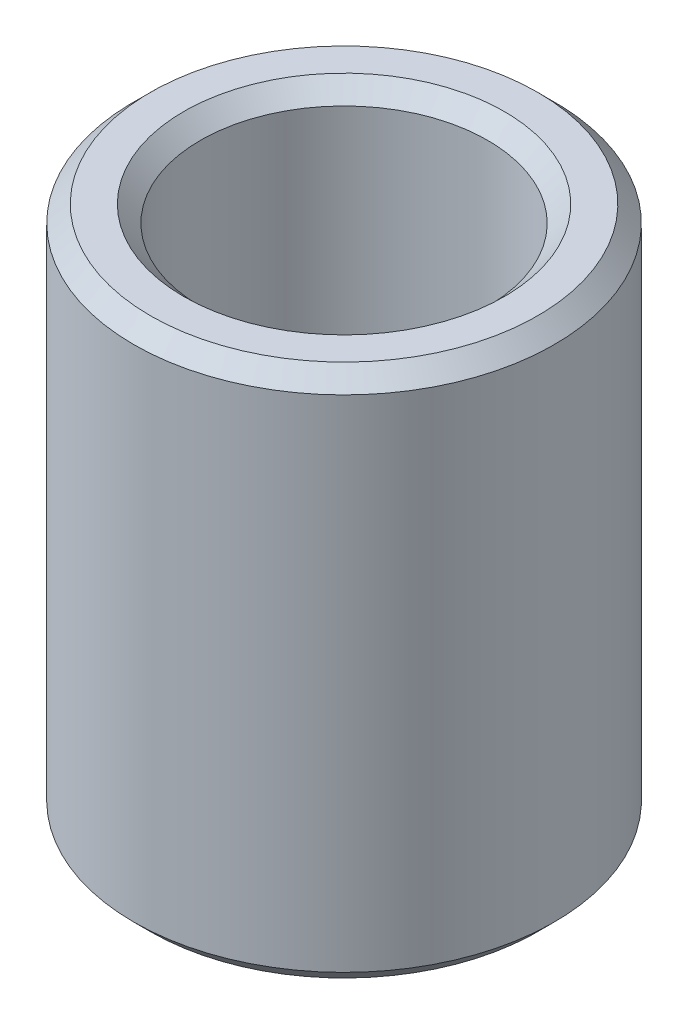
ISO-10303-21;
HEADER;
FILE_DESCRIPTION(('STEP AP214'),'2;1');
FILE_NAME('part.step','',(''),(''),'','','');
FILE_SCHEMA(('AUTOMOTIVE_DESIGN { 1 0 10303 214 1 1 1 1 }'));
ENDSEC;
DATA;
#1=APPLICATION_CONTEXT('core data for automotive mechanical design processes');
#2=APPLICATION_PROTOCOL_DEFINITION('international standard','automotive_design',2000,#1);
#3=PRODUCT_CONTEXT('',#1,'mechanical');
#4=PRODUCT('Part','Part','',(#3));
#5=PRODUCT_RELATED_PRODUCT_CATEGORY('part','',(#4));
#6=PRODUCT_DEFINITION_FORMATION('','',#4);
#7=PRODUCT_DEFINITION_CONTEXT('part definition',#1,'design');
#8=PRODUCT_DEFINITION('design','',#6,#7);
#9=PRODUCT_DEFINITION_SHAPE('','',#8);
#10=(LENGTH_UNIT() NAMED_UNIT(*) SI_UNIT(.MILLI.,.METRE.));
#11=(NAMED_UNIT(*) PLANE_ANGLE_UNIT() SI_UNIT($,.RADIAN.));
#12=(NAMED_UNIT(*) SI_UNIT($,.STERADIAN.) SOLID_ANGLE_UNIT());
#13=UNCERTAINTY_MEASURE_WITH_UNIT(LENGTH_MEASURE(1.E-05),#10,'distance_accuracy_value','');
#14=(GEOMETRIC_REPRESENTATION_CONTEXT(3) GLOBAL_UNCERTAINTY_ASSIGNED_CONTEXT((#13)) GLOBAL_UNIT_ASSIGNED_CONTEXT((#10,
#11,#12)) REPRESENTATION_CONTEXT('',''));
#15=CARTESIAN_POINT('',(0.,0.,0.));
#16=DIRECTION('',(0.,0.,1.));
#17=DIRECTION('',(1.,0.,0.));
#18=AXIS2_PLACEMENT_3D('',#15,#16,#17);
#19=CARTESIAN_POINT('',(0.,88.7984942191137,0.));
#20=DIRECTION('',(0.,-1.,0.));
#21=DIRECTION('',(0.,0.,-1.));
#22=AXIS2_PLACEMENT_3D('',#19,#20,#21);
#23=CYLINDRICAL_SURFACE('',#22,35.);
#24=CARTESIAN_POINT('',(0.,2.77090591905356,0.));
#25=DIRECTION('',(0.,1.,0.));
#26=DIRECTION('',(0.,0.,1.));
#27=AXIS2_PLACEMENT_3D('',#24,#25,#26);
#28=CIRCLE('',#27,35.);
#29=CARTESIAN_POINT('',(0.,2.77090591905356,35.));
#30=VERTEX_POINT('',#29);
#31=EDGE_CURVE('E10',#30,#30,#28,.T.);
#32=ORIENTED_EDGE('',*,*,#31,.T.);
#33=EDGE_LOOP('',(#32));
#34=FACE_BOUND('',#33,.T.);
#35=CARTESIAN_POINT('',(0.,86.0275883000601,0.));
#36=DIRECTION('',(0.,1.,0.));
#37=DIRECTION('',(0.,0.,1.));
#38=AXIS2_PLACEMENT_3D('',#35,#36,#37);
#39=CIRCLE('',#38,35.);
#40=CARTESIAN_POINT('',(0.,86.0275883000601,35.));
#41=VERTEX_POINT('',#40);
#42=EDGE_CURVE('E50',#41,#41,#39,.F.);
#43=ORIENTED_EDGE('',*,*,#42,.T.);
#44=EDGE_LOOP('',(#43));
#45=FACE_BOUND('',#44,.T.);
#46=ADVANCED_FACE('F39',(#34,#45),#23,.T.);
#47=CARTESIAN_POINT('',(0.,88.7984942191137,0.));
#48=DIRECTION('',(0.,1.,0.));
#49=DIRECTION('',(0.,0.,1.));
#50=AXIS2_PLACEMENT_3D('',#47,#48,#49);
#51=PLANE('',#50);
#52=CARTESIAN_POINT('',(0.,88.7984942191137,0.));
#53=DIRECTION('',(0.,1.,0.));
#54=DIRECTION('',(0.,0.,1.));
#55=AXIS2_PLACEMENT_3D('',#52,#53,#54);
#56=CIRCLE('',#55,26.6887011215649);
#57=CARTESIAN_POINT('',(0.,88.7984942191137,26.6887011215649));
#58=VERTEX_POINT('',#57);
#59=EDGE_CURVE('E58',#58,#58,#56,.F.);
#60=ORIENTED_EDGE('',*,*,#59,.T.);
#61=EDGE_LOOP('',(#60));
#62=FACE_BOUND('',#61,.T.);
#63=CARTESIAN_POINT('',(0.,88.7984942191137,0.));
#64=DIRECTION('',(0.,1.,0.));
#65=DIRECTION('',(0.,0.,1.));
#66=AXIS2_PLACEMENT_3D('',#63,#64,#65);
#67=CIRCLE('',#66,32.2290940809464);
#68=CARTESIAN_POINT('',(0.,88.7984942191137,32.2290940809464));
#69=VERTEX_POINT('',#68);
#70=EDGE_CURVE('E61',#69,#69,#67,.T.);
#71=ORIENTED_EDGE('',*,*,#70,.T.);
#72=EDGE_LOOP('',(#71));
#73=FACE_BOUND('',#72,.T.);
#74=ADVANCED_FACE('F88',(#62,#73),#51,.T.);
#75=CARTESIAN_POINT('',(0.,0.,0.));
#76=DIRECTION('',(0.,1.,0.));
#77=DIRECTION('',(0.,0.,1.));
#78=AXIS2_PLACEMENT_3D('',#75,#76,#77);
#79=PLANE('',#78);
#80=CARTESIAN_POINT('',(0.,0.,0.));
#81=DIRECTION('',(0.,1.,0.));
#82=DIRECTION('',(0.,0.,1.));
#83=AXIS2_PLACEMENT_3D('',#80,#81,#82);
#84=CIRCLE('',#83,26.6887011215649);
#85=CARTESIAN_POINT('',(0.,0.,26.6887011215649));
#86=VERTEX_POINT('',#85);
#87=EDGE_CURVE('E51',#86,#86,#84,.T.);
#88=ORIENTED_EDGE('',*,*,#87,.T.);
#89=EDGE_LOOP('',(#88));
#90=FACE_BOUND('',#89,.T.);
#91=CARTESIAN_POINT('',(0.,0.,0.));
#92=DIRECTION('',(0.,1.,0.));
#93=DIRECTION('',(0.,0.,1.));
#94=AXIS2_PLACEMENT_3D('',#91,#92,#93);
#95=CIRCLE('',#94,32.2290940809464);
#96=CARTESIAN_POINT('',(0.,0.,32.2290940809464));
#97=VERTEX_POINT('',#96);
#98=EDGE_CURVE('E54',#97,#97,#95,.F.);
#99=ORIENTED_EDGE('',*,*,#98,.T.);
#100=EDGE_LOOP('',(#99));
#101=FACE_BOUND('',#100,.T.);
#102=ADVANCED_FACE('F83',(#90,#101),#79,.F.);
#103=CARTESIAN_POINT('',(0.,88.7984942191137,0.));
#104=DIRECTION('',(0.,-1.,0.));
#105=DIRECTION('',(0.,0.,-1.));
#106=AXIS2_PLACEMENT_3D('',#103,#104,#105);
#107=CYLINDRICAL_SURFACE('',#106,23.9177952025113);
#108=CARTESIAN_POINT('',(0.,86.0275883000601,0.));
#109=DIRECTION('',(0.,1.,0.));
#110=DIRECTION('',(0.,0.,1.));
#111=AXIS2_PLACEMENT_3D('',#108,#109,#110);
#112=CIRCLE('',#111,23.9177952025113);
#113=CARTESIAN_POINT('',(0.,86.0275883000601,23.9177952025113));
#114=VERTEX_POINT('',#113);
#115=EDGE_CURVE('E67',#114,#114,#112,.T.);
#116=ORIENTED_EDGE('',*,*,#115,.T.);
#117=EDGE_LOOP('',(#116));
#118=FACE_BOUND('',#117,.T.);
#119=CARTESIAN_POINT('',(0.,2.77090591905363,0.));
#120=DIRECTION('',(0.,1.,0.));
#121=DIRECTION('',(0.,0.,1.));
#122=AXIS2_PLACEMENT_3D('',#119,#120,#121);
#123=CIRCLE('',#122,23.9177952025113);
#124=CARTESIAN_POINT('',(0.,2.77090591905363,23.9177952025113));
#125=VERTEX_POINT('',#124);
#126=EDGE_CURVE('E69',#125,#125,#123,.F.);
#127=ORIENTED_EDGE('',*,*,#126,.T.);
#128=EDGE_LOOP('',(#127));
#129=FACE_BOUND('',#128,.T.);
#130=ADVANCED_FACE('F71',(#118,#129),#107,.F.);
#131=CARTESIAN_POINT('',(0.,86.0275883000601,0.));
#132=DIRECTION('',(0.,1.,0.));
#133=DIRECTION('',(0.,0.,1.));
#134=AXIS2_PLACEMENT_3D('',#131,#132,#133);
#135=CONICAL_SURFACE('',#134,23.9177952025113,0.785398163397453);
#136=ORIENTED_EDGE('',*,*,#59,.F.);
#137=EDGE_LOOP('',(#136));
#138=FACE_BOUND('',#137,.T.);
#139=ORIENTED_EDGE('',*,*,#115,.F.);
#140=EDGE_LOOP('',(#139));
#141=FACE_BOUND('',#140,.T.);
#142=ADVANCED_FACE('F77',(#138,#141),#135,.F.);
#143=CARTESIAN_POINT('',(0.,0.,0.));
#144=DIRECTION('',(0.,-1.,0.));
#145=DIRECTION('',(0.,0.,-1.));
#146=AXIS2_PLACEMENT_3D('',#143,#144,#145);
#147=CONICAL_SURFACE('',#146,26.6887011215649,0.785398163397443);
#148=ORIENTED_EDGE('',*,*,#126,.F.);
#149=EDGE_LOOP('',(#148));
#150=FACE_BOUND('',#149,.T.);
#151=ORIENTED_EDGE('',*,*,#87,.F.);
#152=EDGE_LOOP('',(#151));
#153=FACE_BOUND('',#152,.T.);
#154=ADVANCED_FACE('F73',(#150,#153),#147,.F.);
#155=CARTESIAN_POINT('',(0.,2.77090591905356,0.));
#156=DIRECTION('',(0.,1.,0.));
#157=DIRECTION('',(0.,0.,1.));
#158=AXIS2_PLACEMENT_3D('',#155,#156,#157);
#159=CONICAL_SURFACE('',#158,35.,0.785398163397455);
#160=ORIENTED_EDGE('',*,*,#98,.F.);
#161=EDGE_LOOP('',(#160));
#162=FACE_BOUND('',#161,.T.);
#163=ORIENTED_EDGE('',*,*,#31,.F.);
#164=EDGE_LOOP('',(#163));
#165=FACE_BOUND('',#164,.T.);
#166=ADVANCED_FACE('F76',(#162,#165),#159,.T.);
#167=CARTESIAN_POINT('',(0.,88.7984942191137,0.));
#168=DIRECTION('',(0.,-1.,0.));
#169=DIRECTION('',(0.,0.,-1.));
#170=AXIS2_PLACEMENT_3D('',#167,#168,#169);
#171=CONICAL_SURFACE('',#170,32.2290940809464,0.785398163397445);
#172=ORIENTED_EDGE('',*,*,#42,.F.);
#173=EDGE_LOOP('',(#172));
#174=FACE_BOUND('',#173,.T.);
#175=ORIENTED_EDGE('',*,*,#70,.F.);
#176=EDGE_LOOP('',(#175));
#177=FACE_BOUND('',#176,.T.);
#178=ADVANCED_FACE('F45',(#174,#177),#171,.T.);
#179=CLOSED_SHELL('',(#46,#74,#102,#130,#142,#154,#166,#178));
#180=MANIFOLD_SOLID_BREP('B2',#179);
#181=ADVANCED_BREP_SHAPE_REPRESENTATION('',(#18,#180),#14);
#182=SHAPE_DEFINITION_REPRESENTATION(#9,#181);
ENDSEC;
END-ISO-10303-21;
